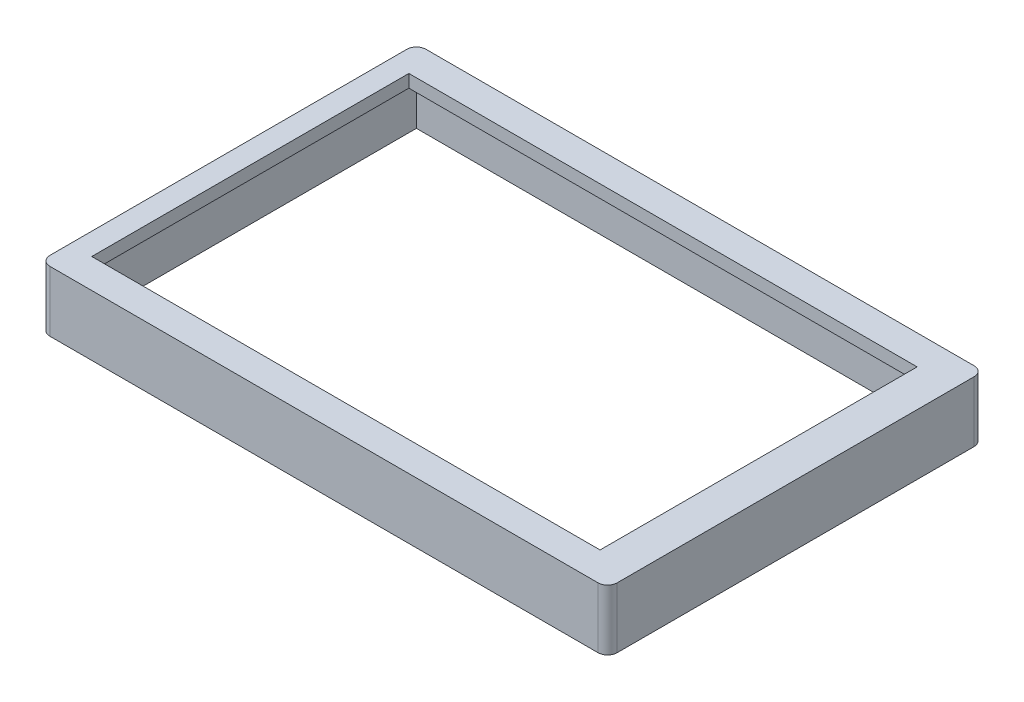
ISO-10303-21;
HEADER;
FILE_DESCRIPTION(('STEP AP214'),'2;1');
FILE_NAME('part.step','',(''),(''),'','','');
FILE_SCHEMA(('AUTOMOTIVE_DESIGN { 1 0 10303 214 1 1 1 1 }'));
ENDSEC;
DATA;
#1=APPLICATION_CONTEXT('core data for automotive mechanical design processes');
#2=APPLICATION_PROTOCOL_DEFINITION('international standard','automotive_design',2000,#1);
#3=PRODUCT_CONTEXT('',#1,'mechanical');
#4=PRODUCT('Part','Part','',(#3));
#5=PRODUCT_RELATED_PRODUCT_CATEGORY('part','',(#4));
#6=PRODUCT_DEFINITION_FORMATION('','',#4);
#7=PRODUCT_DEFINITION_CONTEXT('part definition',#1,'design');
#8=PRODUCT_DEFINITION('design','',#6,#7);
#9=PRODUCT_DEFINITION_SHAPE('','',#8);
#10=(LENGTH_UNIT() NAMED_UNIT(*) SI_UNIT(.MILLI.,.METRE.));
#11=(NAMED_UNIT(*) PLANE_ANGLE_UNIT() SI_UNIT($,.RADIAN.));
#12=(NAMED_UNIT(*) SI_UNIT($,.STERADIAN.) SOLID_ANGLE_UNIT());
#13=UNCERTAINTY_MEASURE_WITH_UNIT(LENGTH_MEASURE(1.E-05),#10,'distance_accuracy_value','');
#14=(GEOMETRIC_REPRESENTATION_CONTEXT(3) GLOBAL_UNCERTAINTY_ASSIGNED_CONTEXT((#13)) GLOBAL_UNIT_ASSIGNED_CONTEXT((#10,
#11,#12)) REPRESENTATION_CONTEXT('',''));
#15=CARTESIAN_POINT('',(0.,0.,0.));
#16=DIRECTION('',(0.,0.,1.));
#17=DIRECTION('',(1.,0.,0.));
#18=AXIS2_PLACEMENT_3D('',#15,#16,#17);
#19=CARTESIAN_POINT('',(0.,4.,0.));
#20=DIRECTION('',(0.,1.,0.));
#21=DIRECTION('',(0.,0.,1.));
#22=AXIS2_PLACEMENT_3D('',#19,#20,#21);
#23=PLANE('',#22);
#24=DIRECTION('',(-1.,0.,0.));
#25=VECTOR('',#24,1.);
#26=CARTESIAN_POINT('',(-86.6347978675137,4.,-59.));
#27=LINE('',#26,#25);
#28=CARTESIAN_POINT('',(88.3652021324864,4.,-59.));
#29=VERTEX_POINT('',#28);
#30=CARTESIAN_POINT('',(-83.6347978675137,4.,-59.));
#31=VERTEX_POINT('',#30);
#32=EDGE_CURVE('E239',#29,#31,#27,.T.);
#33=ORIENTED_EDGE('',*,*,#32,.T.);
#34=CARTESIAN_POINT('',(-83.6347978675137,4.,-56.));
#35=DIRECTION('',(0.,1.,0.));
#36=DIRECTION('',(0.,0.,1.));
#37=AXIS2_PLACEMENT_3D('',#34,#35,#36);
#38=CIRCLE('',#37,3.);
#39=CARTESIAN_POINT('',(-86.6347978675137,4.,-56.));
#40=VERTEX_POINT('',#39);
#41=EDGE_CURVE('E265',#31,#40,#38,.T.);
#42=ORIENTED_EDGE('',*,*,#41,.T.);
#43=DIRECTION('',(0.,0.,1.));
#44=VECTOR('',#43,1.);
#45=CARTESIAN_POINT('',(-86.6347978675137,4.,-59.));
#46=LINE('',#45,#44);
#47=CARTESIAN_POINT('',(-86.6347978675137,4.,56.));
#48=VERTEX_POINT('',#47);
#49=EDGE_CURVE('E232',#40,#48,#46,.T.);
#50=ORIENTED_EDGE('',*,*,#49,.T.);
#51=CARTESIAN_POINT('',(-83.6347978675137,4.,56.));
#52=DIRECTION('',(0.,1.,0.));
#53=DIRECTION('',(0.,0.,1.));
#54=AXIS2_PLACEMENT_3D('',#51,#52,#53);
#55=CIRCLE('',#54,3.);
#56=CARTESIAN_POINT('',(-83.6347978675137,4.,59.));
#57=VERTEX_POINT('',#56);
#58=EDGE_CURVE('E260',#48,#57,#55,.T.);
#59=ORIENTED_EDGE('',*,*,#58,.T.);
#60=DIRECTION('',(1.,0.,0.));
#61=VECTOR('',#60,1.);
#62=CARTESIAN_POINT('',(-86.6347978675137,4.,59.));
#63=LINE('',#62,#61);
#64=CARTESIAN_POINT('',(88.3652021324864,4.,59.));
#65=VERTEX_POINT('',#64);
#66=EDGE_CURVE('E235',#57,#65,#63,.T.);
#67=ORIENTED_EDGE('',*,*,#66,.T.);
#68=CARTESIAN_POINT('',(88.3652021324864,4.,56.));
#69=DIRECTION('',(0.,1.,0.));
#70=DIRECTION('',(0.,0.,1.));
#71=AXIS2_PLACEMENT_3D('',#68,#69,#70);
#72=CIRCLE('',#71,3.);
#73=CARTESIAN_POINT('',(91.3652021324864,4.,56.));
#74=VERTEX_POINT('',#73);
#75=EDGE_CURVE('E55',#65,#74,#72,.T.);
#76=ORIENTED_EDGE('',*,*,#75,.T.);
#77=DIRECTION('',(0.,0.,-1.));
#78=VECTOR('',#77,1.);
#79=CARTESIAN_POINT('',(91.3652021324864,4.,-59.));
#80=LINE('',#79,#78);
#81=CARTESIAN_POINT('',(91.3652021324864,4.,-56.));
#82=VERTEX_POINT('',#81);
#83=EDGE_CURVE('E237',#74,#82,#80,.T.);
#84=ORIENTED_EDGE('',*,*,#83,.T.);
#85=CARTESIAN_POINT('',(88.3652021324864,4.,-56.));
#86=DIRECTION('',(0.,1.,0.));
#87=DIRECTION('',(0.,0.,1.));
#88=AXIS2_PLACEMENT_3D('',#85,#86,#87);
#89=CIRCLE('',#88,3.);
#90=EDGE_CURVE('E263',#82,#29,#89,.T.);
#91=ORIENTED_EDGE('',*,*,#90,.T.);
#92=EDGE_LOOP('',(#33,#42,#50,#59,#67,#76,#84,#91));
#93=FACE_BOUND('',#92,.T.);
#94=DIRECTION('',(-1.,0.,0.));
#95=VECTOR('',#94,1.);
#96=CARTESIAN_POINT('',(-79.75,4.,-49.75));
#97=LINE('',#96,#95);
#98=CARTESIAN_POINT('',(79.75,4.,-49.75));
#99=VERTEX_POINT('',#98);
#100=CARTESIAN_POINT('',(-79.75,4.,-49.75));
#101=VERTEX_POINT('',#100);
#102=EDGE_CURVE('E204',#99,#101,#97,.T.);
#103=ORIENTED_EDGE('',*,*,#102,.F.);
#104=DIRECTION('',(0.,0.,-1.));
#105=VECTOR('',#104,1.);
#106=CARTESIAN_POINT('',(79.75,4.,-49.75));
#107=LINE('',#106,#105);
#108=CARTESIAN_POINT('',(79.75,4.,49.75));
#109=VERTEX_POINT('',#108);
#110=EDGE_CURVE('E202',#109,#99,#107,.T.);
#111=ORIENTED_EDGE('',*,*,#110,.F.);
#112=DIRECTION('',(1.,0.,0.));
#113=VECTOR('',#112,1.);
#114=CARTESIAN_POINT('',(-79.75,4.,49.75));
#115=LINE('',#114,#113);
#116=CARTESIAN_POINT('',(-79.75,4.,49.75));
#117=VERTEX_POINT('',#116);
#118=EDGE_CURVE('E210',#117,#109,#115,.T.);
#119=ORIENTED_EDGE('',*,*,#118,.F.);
#120=DIRECTION('',(0.,0.,1.));
#121=VECTOR('',#120,1.);
#122=CARTESIAN_POINT('',(-79.75,4.,-49.75));
#123=LINE('',#122,#121);
#124=EDGE_CURVE('E207',#101,#117,#123,.T.);
#125=ORIENTED_EDGE('',*,*,#124,.F.);
#126=EDGE_LOOP('',(#103,#111,#119,#125));
#127=FACE_BOUND('',#126,.T.);
#128=ADVANCED_FACE('F33',(#93,#127),#23,.T.);
#129=CARTESIAN_POINT('',(0.,0.,0.));
#130=DIRECTION('',(0.,1.,0.));
#131=DIRECTION('',(0.,0.,1.));
#132=AXIS2_PLACEMENT_3D('',#129,#130,#131);
#133=PLANE('',#132);
#134=DIRECTION('',(0.,0.,1.));
#135=VECTOR('',#134,1.);
#136=CARTESIAN_POINT('',(87.3652021324864,0.,-55.));
#137=LINE('',#136,#135);
#138=CARTESIAN_POINT('',(87.3652021324864,0.,-55.));
#139=VERTEX_POINT('',#138);
#140=CARTESIAN_POINT('',(87.3652021324864,0.,55.));
#141=VERTEX_POINT('',#140);
#142=EDGE_CURVE('E159',#139,#141,#137,.T.);
#143=ORIENTED_EDGE('',*,*,#142,.T.);
#144=DIRECTION('',(-1.,0.,0.));
#145=VECTOR('',#144,1.);
#146=CARTESIAN_POINT('',(87.3652021324864,0.,55.));
#147=LINE('',#146,#145);
#148=CARTESIAN_POINT('',(-82.6347978675137,0.,55.));
#149=VERTEX_POINT('',#148);
#150=EDGE_CURVE('E178',#141,#149,#147,.T.);
#151=ORIENTED_EDGE('',*,*,#150,.T.);
#152=DIRECTION('',(0.,0.,-1.));
#153=VECTOR('',#152,1.);
#154=CARTESIAN_POINT('',(-82.6347978675137,0.,55.));
#155=LINE('',#154,#153);
#156=CARTESIAN_POINT('',(-82.6347978675137,0.,-55.));
#157=VERTEX_POINT('',#156);
#158=EDGE_CURVE('E165',#149,#157,#155,.T.);
#159=ORIENTED_EDGE('',*,*,#158,.T.);
#160=DIRECTION('',(1.,0.,0.));
#161=VECTOR('',#160,1.);
#162=CARTESIAN_POINT('',(-82.6347978675137,0.,-55.));
#163=LINE('',#162,#161);
#164=EDGE_CURVE('E181',#157,#139,#163,.T.);
#165=ORIENTED_EDGE('',*,*,#164,.T.);
#166=EDGE_LOOP('',(#143,#151,#159,#165));
#167=FACE_BOUND('',#166,.T.);
#168=DIRECTION('',(0.,0.,-1.));
#169=VECTOR('',#168,1.);
#170=CARTESIAN_POINT('',(79.75,0.,-49.75));
#171=LINE('',#170,#169);
#172=CARTESIAN_POINT('',(79.75,0.,49.75));
#173=VERTEX_POINT('',#172);
#174=CARTESIAN_POINT('',(79.75,0.,-49.75));
#175=VERTEX_POINT('',#174);
#176=EDGE_CURVE('E201',#173,#175,#171,.T.);
#177=ORIENTED_EDGE('',*,*,#176,.T.);
#178=DIRECTION('',(-1.,0.,0.));
#179=VECTOR('',#178,1.);
#180=CARTESIAN_POINT('',(-79.75,0.,-49.75));
#181=LINE('',#180,#179);
#182=CARTESIAN_POINT('',(-79.75,0.,-49.75));
#183=VERTEX_POINT('',#182);
#184=EDGE_CURVE('E215',#175,#183,#181,.T.);
#185=ORIENTED_EDGE('',*,*,#184,.T.);
#186=DIRECTION('',(0.,0.,1.));
#187=VECTOR('',#186,1.);
#188=CARTESIAN_POINT('',(-79.75,0.,-49.75));
#189=LINE('',#188,#187);
#190=CARTESIAN_POINT('',(-79.75,0.,49.75));
#191=VERTEX_POINT('',#190);
#192=EDGE_CURVE('E218',#183,#191,#189,.T.);
#193=ORIENTED_EDGE('',*,*,#192,.T.);
#194=DIRECTION('',(1.,0.,0.));
#195=VECTOR('',#194,1.);
#196=CARTESIAN_POINT('',(-79.75,0.,49.75));
#197=LINE('',#196,#195);
#198=EDGE_CURVE('E205',#191,#173,#197,.T.);
#199=ORIENTED_EDGE('',*,*,#198,.T.);
#200=EDGE_LOOP('',(#177,#185,#193,#199));
#201=FACE_BOUND('',#200,.T.);
#202=ADVANCED_FACE('F308',(#167,#201),#133,.F.);
#203=CARTESIAN_POINT('',(-86.6347978675137,4.,-59.));
#204=DIRECTION('',(1.,0.,0.));
#205=DIRECTION('',(0.,0.,-1.));
#206=AXIS2_PLACEMENT_3D('',#203,#204,#205);
#207=PLANE('',#206);
#208=ORIENTED_EDGE('',*,*,#49,.F.);
#209=DIRECTION('',(0.,-1.,0.));
#210=VECTOR('',#209,1.);
#211=CARTESIAN_POINT('',(-86.6347978675137,4.,-56.));
#212=LINE('',#211,#210);
#213=CARTESIAN_POINT('',(-86.6347978675137,-15.,-56.));
#214=VERTEX_POINT('',#213);
#215=EDGE_CURVE('E244',#40,#214,#212,.T.);
#216=ORIENTED_EDGE('',*,*,#215,.T.);
#217=DIRECTION('',(0.,0.,-1.));
#218=VECTOR('',#217,1.);
#219=CARTESIAN_POINT('',(-86.6347978675137,-15.,59.));
#220=LINE('',#219,#218);
#221=CARTESIAN_POINT('',(-86.6347978675137,-15.,56.));
#222=VERTEX_POINT('',#221);
#223=EDGE_CURVE('E192',#222,#214,#220,.T.);
#224=ORIENTED_EDGE('',*,*,#223,.F.);
#225=DIRECTION('',(0.,-1.,0.));
#226=VECTOR('',#225,1.);
#227=CARTESIAN_POINT('',(-86.6347978675137,4.,56.));
#228=LINE('',#227,#226);
#229=EDGE_CURVE('E242',#222,#48,#228,.F.);
#230=ORIENTED_EDGE('',*,*,#229,.T.);
#231=EDGE_LOOP('',(#208,#216,#224,#230));
#232=FACE_BOUND('',#231,.T.);
#233=ADVANCED_FACE('F301',(#232),#207,.F.);
#234=CARTESIAN_POINT('',(-86.6347978675137,4.,59.));
#235=DIRECTION('',(0.,0.,-1.));
#236=DIRECTION('',(-1.,0.,0.));
#237=AXIS2_PLACEMENT_3D('',#234,#235,#236);
#238=PLANE('',#237);
#239=DIRECTION('',(-1.,0.,0.));
#240=VECTOR('',#239,1.);
#241=CARTESIAN_POINT('',(91.3652021324864,-15.,59.));
#242=LINE('',#241,#240);
#243=CARTESIAN_POINT('',(88.3652021324864,-15.,59.));
#244=VERTEX_POINT('',#243);
#245=CARTESIAN_POINT('',(-83.6347978675137,-15.,59.));
#246=VERTEX_POINT('',#245);
#247=EDGE_CURVE('E166',#244,#246,#242,.T.);
#248=ORIENTED_EDGE('',*,*,#247,.F.);
#249=DIRECTION('',(0.,-1.,0.));
#250=VECTOR('',#249,1.);
#251=CARTESIAN_POINT('',(88.3652021324864,4.,59.));
#252=LINE('',#251,#250);
#253=EDGE_CURVE('E11',#244,#65,#252,.F.);
#254=ORIENTED_EDGE('',*,*,#253,.T.);
#255=ORIENTED_EDGE('',*,*,#66,.F.);
#256=DIRECTION('',(0.,-1.,0.));
#257=VECTOR('',#256,1.);
#258=CARTESIAN_POINT('',(-83.6347978675137,4.,59.));
#259=LINE('',#258,#257);
#260=EDGE_CURVE('E41',#57,#246,#259,.T.);
#261=ORIENTED_EDGE('',*,*,#260,.T.);
#262=EDGE_LOOP('',(#248,#254,#255,#261));
#263=FACE_BOUND('',#262,.T.);
#264=ADVANCED_FACE('F275',(#263),#238,.F.);
#265=CARTESIAN_POINT('',(91.3652021324864,4.,-59.));
#266=DIRECTION('',(-1.,0.,0.));
#267=DIRECTION('',(0.,0.,1.));
#268=AXIS2_PLACEMENT_3D('',#265,#266,#267);
#269=PLANE('',#268);
#270=DIRECTION('',(0.,0.,1.));
#271=VECTOR('',#270,1.);
#272=CARTESIAN_POINT('',(91.3652021324864,-15.,-59.));
#273=LINE('',#272,#271);
#274=CARTESIAN_POINT('',(91.3652021324864,-15.,-56.));
#275=VERTEX_POINT('',#274);
#276=CARTESIAN_POINT('',(91.3652021324864,-15.,56.));
#277=VERTEX_POINT('',#276);
#278=EDGE_CURVE('E198',#275,#277,#273,.T.);
#279=ORIENTED_EDGE('',*,*,#278,.F.);
#280=DIRECTION('',(0.,-1.,0.));
#281=VECTOR('',#280,1.);
#282=CARTESIAN_POINT('',(91.3652021324864,4.,-56.));
#283=LINE('',#282,#281);
#284=EDGE_CURVE('E48',#275,#82,#283,.F.);
#285=ORIENTED_EDGE('',*,*,#284,.T.);
#286=ORIENTED_EDGE('',*,*,#83,.F.);
#287=DIRECTION('',(0.,-1.,0.));
#288=VECTOR('',#287,1.);
#289=CARTESIAN_POINT('',(91.3652021324864,4.,56.));
#290=LINE('',#289,#288);
#291=EDGE_CURVE('E267',#74,#277,#290,.T.);
#292=ORIENTED_EDGE('',*,*,#291,.T.);
#293=EDGE_LOOP('',(#279,#285,#286,#292));
#294=FACE_BOUND('',#293,.T.);
#295=ADVANCED_FACE('F284',(#294),#269,.F.);
#296=CARTESIAN_POINT('',(-86.6347978675137,4.,-59.));
#297=DIRECTION('',(0.,0.,1.));
#298=DIRECTION('',(1.,0.,0.));
#299=AXIS2_PLACEMENT_3D('',#296,#297,#298);
#300=PLANE('',#299);
#301=DIRECTION('',(1.,0.,0.));
#302=VECTOR('',#301,1.);
#303=CARTESIAN_POINT('',(-86.6347978675137,-15.,-59.));
#304=LINE('',#303,#302);
#305=CARTESIAN_POINT('',(-83.6347978675137,-15.,-59.));
#306=VERTEX_POINT('',#305);
#307=CARTESIAN_POINT('',(88.3652021324864,-15.,-59.));
#308=VERTEX_POINT('',#307);
#309=EDGE_CURVE('E195',#306,#308,#304,.T.);
#310=ORIENTED_EDGE('',*,*,#309,.F.);
#311=DIRECTION('',(0.,-1.,0.));
#312=VECTOR('',#311,1.);
#313=CARTESIAN_POINT('',(-83.6347978675137,4.,-59.));
#314=LINE('',#313,#312);
#315=EDGE_CURVE('E258',#306,#31,#314,.F.);
#316=ORIENTED_EDGE('',*,*,#315,.T.);
#317=ORIENTED_EDGE('',*,*,#32,.F.);
#318=DIRECTION('',(0.,-1.,0.));
#319=VECTOR('',#318,1.);
#320=CARTESIAN_POINT('',(88.3652021324864,4.,-59.));
#321=LINE('',#320,#319);
#322=EDGE_CURVE('E255',#29,#308,#321,.T.);
#323=ORIENTED_EDGE('',*,*,#322,.T.);
#324=EDGE_LOOP('',(#310,#316,#317,#323));
#325=FACE_BOUND('',#324,.T.);
#326=ADVANCED_FACE('F293',(#325),#300,.F.);
#327=CARTESIAN_POINT('',(79.75,4.,-49.75));
#328=DIRECTION('',(-1.,0.,0.));
#329=DIRECTION('',(0.,0.,1.));
#330=AXIS2_PLACEMENT_3D('',#327,#328,#329);
#331=PLANE('',#330);
#332=ORIENTED_EDGE('',*,*,#176,.F.);
#333=DIRECTION('',(0.,-1.,0.));
#334=VECTOR('',#333,1.);
#335=CARTESIAN_POINT('',(79.75,4.,49.75));
#336=LINE('',#335,#334);
#337=EDGE_CURVE('E212',#109,#173,#336,.T.);
#338=ORIENTED_EDGE('',*,*,#337,.F.);
#339=ORIENTED_EDGE('',*,*,#110,.T.);
#340=DIRECTION('',(0.,-1.,0.));
#341=VECTOR('',#340,1.);
#342=CARTESIAN_POINT('',(79.75,4.,-49.75));
#343=LINE('',#342,#341);
#344=EDGE_CURVE('E229',#99,#175,#343,.T.);
#345=ORIENTED_EDGE('',*,*,#344,.T.);
#346=EDGE_LOOP('',(#332,#338,#339,#345));
#347=FACE_BOUND('',#346,.T.);
#348=ADVANCED_FACE('F316',(#347),#331,.T.);
#349=CARTESIAN_POINT('',(-79.75,4.,-49.75));
#350=DIRECTION('',(0.,0.,1.));
#351=DIRECTION('',(1.,0.,0.));
#352=AXIS2_PLACEMENT_3D('',#349,#350,#351);
#353=PLANE('',#352);
#354=ORIENTED_EDGE('',*,*,#184,.F.);
#355=ORIENTED_EDGE('',*,*,#344,.F.);
#356=ORIENTED_EDGE('',*,*,#102,.T.);
#357=DIRECTION('',(0.,-1.,0.));
#358=VECTOR('',#357,1.);
#359=CARTESIAN_POINT('',(-79.75,4.,-49.75));
#360=LINE('',#359,#358);
#361=EDGE_CURVE('E227',#101,#183,#360,.T.);
#362=ORIENTED_EDGE('',*,*,#361,.T.);
#363=EDGE_LOOP('',(#354,#355,#356,#362));
#364=FACE_BOUND('',#363,.T.);
#365=ADVANCED_FACE('F442',(#364),#353,.T.);
#366=CARTESIAN_POINT('',(-79.75,4.,-49.75));
#367=DIRECTION('',(1.,0.,0.));
#368=DIRECTION('',(0.,0.,-1.));
#369=AXIS2_PLACEMENT_3D('',#366,#367,#368);
#370=PLANE('',#369);
#371=ORIENTED_EDGE('',*,*,#192,.F.);
#372=ORIENTED_EDGE('',*,*,#361,.F.);
#373=ORIENTED_EDGE('',*,*,#124,.T.);
#374=DIRECTION('',(0.,-1.,0.));
#375=VECTOR('',#374,1.);
#376=CARTESIAN_POINT('',(-79.75,4.,49.75));
#377=LINE('',#376,#375);
#378=EDGE_CURVE('E225',#117,#191,#377,.T.);
#379=ORIENTED_EDGE('',*,*,#378,.T.);
#380=EDGE_LOOP('',(#371,#372,#373,#379));
#381=FACE_BOUND('',#380,.T.);
#382=ADVANCED_FACE('F433',(#381),#370,.T.);
#383=CARTESIAN_POINT('',(-79.75,4.,49.75));
#384=DIRECTION('',(0.,0.,-1.));
#385=DIRECTION('',(-1.,0.,0.));
#386=AXIS2_PLACEMENT_3D('',#383,#384,#385);
#387=PLANE('',#386);
#388=ORIENTED_EDGE('',*,*,#198,.F.);
#389=ORIENTED_EDGE('',*,*,#378,.F.);
#390=ORIENTED_EDGE('',*,*,#118,.T.);
#391=ORIENTED_EDGE('',*,*,#337,.T.);
#392=EDGE_LOOP('',(#388,#389,#390,#391));
#393=FACE_BOUND('',#392,.T.);
#394=ADVANCED_FACE('F391',(#393),#387,.T.);
#395=CARTESIAN_POINT('',(0.,-15.,0.));
#396=DIRECTION('',(0.,-1.,0.));
#397=DIRECTION('',(0.,0.,-1.));
#398=AXIS2_PLACEMENT_3D('',#395,#396,#397);
#399=PLANE('',#398);
#400=ORIENTED_EDGE('',*,*,#223,.T.);
#401=CARTESIAN_POINT('',(-83.6347978675137,-15.,-56.));
#402=DIRECTION('',(0.,-1.,0.));
#403=DIRECTION('',(0.,0.,-1.));
#404=AXIS2_PLACEMENT_3D('',#401,#402,#403);
#405=CIRCLE('',#404,3.);
#406=EDGE_CURVE('E253',#214,#306,#405,.T.);
#407=ORIENTED_EDGE('',*,*,#406,.T.);
#408=ORIENTED_EDGE('',*,*,#309,.T.);
#409=CARTESIAN_POINT('',(88.3652021324864,-15.,-56.));
#410=DIRECTION('',(0.,-1.,0.));
#411=DIRECTION('',(0.,0.,-1.));
#412=AXIS2_PLACEMENT_3D('',#409,#410,#411);
#413=CIRCLE('',#412,3.);
#414=EDGE_CURVE('E251',#308,#275,#413,.T.);
#415=ORIENTED_EDGE('',*,*,#414,.T.);
#416=ORIENTED_EDGE('',*,*,#278,.T.);
#417=CARTESIAN_POINT('',(88.3652021324864,-15.,56.));
#418=DIRECTION('',(0.,-1.,0.));
#419=DIRECTION('',(0.,0.,-1.));
#420=AXIS2_PLACEMENT_3D('',#417,#418,#419);
#421=CIRCLE('',#420,3.);
#422=EDGE_CURVE('E249',#277,#244,#421,.T.);
#423=ORIENTED_EDGE('',*,*,#422,.T.);
#424=ORIENTED_EDGE('',*,*,#247,.T.);
#425=CARTESIAN_POINT('',(-83.6347978675137,-15.,56.));
#426=DIRECTION('',(0.,-1.,0.));
#427=DIRECTION('',(0.,0.,-1.));
#428=AXIS2_PLACEMENT_3D('',#425,#426,#427);
#429=CIRCLE('',#428,3.);
#430=EDGE_CURVE('E247',#246,#222,#429,.T.);
#431=ORIENTED_EDGE('',*,*,#430,.T.);
#432=EDGE_LOOP('',(#400,#407,#408,#415,#416,#423,#424,#431));
#433=FACE_BOUND('',#432,.T.);
#434=DIRECTION('',(0.,0.,-1.));
#435=VECTOR('',#434,1.);
#436=CARTESIAN_POINT('',(-82.6347978675137,-15.,55.));
#437=LINE('',#436,#435);
#438=CARTESIAN_POINT('',(-82.6347978675137,-15.,55.));
#439=VERTEX_POINT('',#438);
#440=CARTESIAN_POINT('',(-82.6347978675137,-15.,-55.));
#441=VERTEX_POINT('',#440);
#442=EDGE_CURVE('E158',#439,#441,#437,.T.);
#443=ORIENTED_EDGE('',*,*,#442,.F.);
#444=DIRECTION('',(-1.,0.,0.));
#445=VECTOR('',#444,1.);
#446=CARTESIAN_POINT('',(87.3652021324864,-15.,55.));
#447=LINE('',#446,#445);
#448=CARTESIAN_POINT('',(87.3652021324864,-15.,55.));
#449=VERTEX_POINT('',#448);
#450=EDGE_CURVE('E148',#449,#439,#447,.T.);
#451=ORIENTED_EDGE('',*,*,#450,.F.);
#452=DIRECTION('',(0.,0.,1.));
#453=VECTOR('',#452,1.);
#454=CARTESIAN_POINT('',(87.3652021324864,-15.,-55.));
#455=LINE('',#454,#453);
#456=CARTESIAN_POINT('',(87.3652021324864,-15.,-55.));
#457=VERTEX_POINT('',#456);
#458=EDGE_CURVE('E174',#457,#449,#455,.T.);
#459=ORIENTED_EDGE('',*,*,#458,.F.);
#460=DIRECTION('',(1.,0.,0.));
#461=VECTOR('',#460,1.);
#462=CARTESIAN_POINT('',(-82.6347978675137,-15.,-55.));
#463=LINE('',#462,#461);
#464=EDGE_CURVE('E172',#441,#457,#463,.T.);
#465=ORIENTED_EDGE('',*,*,#464,.F.);
#466=EDGE_LOOP('',(#443,#451,#459,#465));
#467=FACE_BOUND('',#466,.T.);
#468=ADVANCED_FACE('F170',(#433,#467),#399,.T.);
#469=CARTESIAN_POINT('',(87.3652021324864,-15.,55.));
#470=DIRECTION('',(0.,0.,-1.));
#471=DIRECTION('',(-1.,0.,0.));
#472=AXIS2_PLACEMENT_3D('',#469,#470,#471);
#473=PLANE('',#472);
#474=ORIENTED_EDGE('',*,*,#150,.F.);
#475=DIRECTION('',(0.,1.,0.));
#476=VECTOR('',#475,1.);
#477=CARTESIAN_POINT('',(87.3652021324864,-15.,55.));
#478=LINE('',#477,#476);
#479=EDGE_CURVE('E154',#449,#141,#478,.T.);
#480=ORIENTED_EDGE('',*,*,#479,.F.);
#481=ORIENTED_EDGE('',*,*,#450,.T.);
#482=DIRECTION('',(0.,1.,0.));
#483=VECTOR('',#482,1.);
#484=CARTESIAN_POINT('',(-82.6347978675137,-15.,55.));
#485=LINE('',#484,#483);
#486=EDGE_CURVE('E152',#439,#149,#485,.T.);
#487=ORIENTED_EDGE('',*,*,#486,.T.);
#488=EDGE_LOOP('',(#474,#480,#481,#487));
#489=FACE_BOUND('',#488,.T.);
#490=ADVANCED_FACE('F151',(#489),#473,.T.);
#491=CARTESIAN_POINT('',(-82.6347978675137,-15.,55.));
#492=DIRECTION('',(1.,0.,0.));
#493=DIRECTION('',(0.,0.,-1.));
#494=AXIS2_PLACEMENT_3D('',#491,#492,#493);
#495=PLANE('',#494);
#496=ORIENTED_EDGE('',*,*,#158,.F.);
#497=ORIENTED_EDGE('',*,*,#486,.F.);
#498=ORIENTED_EDGE('',*,*,#442,.T.);
#499=DIRECTION('',(0.,1.,0.));
#500=VECTOR('',#499,1.);
#501=CARTESIAN_POINT('',(-82.6347978675137,-15.,-55.));
#502=LINE('',#501,#500);
#503=EDGE_CURVE('E167',#441,#157,#502,.T.);
#504=ORIENTED_EDGE('',*,*,#503,.T.);
#505=EDGE_LOOP('',(#496,#497,#498,#504));
#506=FACE_BOUND('',#505,.T.);
#507=ADVANCED_FACE('F162',(#506),#495,.T.);
#508=CARTESIAN_POINT('',(-82.6347978675137,-15.,-55.));
#509=DIRECTION('',(0.,0.,1.));
#510=DIRECTION('',(1.,0.,0.));
#511=AXIS2_PLACEMENT_3D('',#508,#509,#510);
#512=PLANE('',#511);
#513=ORIENTED_EDGE('',*,*,#164,.F.);
#514=ORIENTED_EDGE('',*,*,#503,.F.);
#515=ORIENTED_EDGE('',*,*,#464,.T.);
#516=DIRECTION('',(0.,1.,0.));
#517=VECTOR('',#516,1.);
#518=CARTESIAN_POINT('',(87.3652021324864,-15.,-55.));
#519=LINE('',#518,#517);
#520=EDGE_CURVE('E187',#457,#139,#519,.T.);
#521=ORIENTED_EDGE('',*,*,#520,.T.);
#522=EDGE_LOOP('',(#513,#514,#515,#521));
#523=FACE_BOUND('',#522,.T.);
#524=ADVANCED_FACE('F360',(#523),#512,.T.);
#525=CARTESIAN_POINT('',(87.3652021324864,-15.,-55.));
#526=DIRECTION('',(-1.,0.,0.));
#527=DIRECTION('',(0.,0.,1.));
#528=AXIS2_PLACEMENT_3D('',#525,#526,#527);
#529=PLANE('',#528);
#530=ORIENTED_EDGE('',*,*,#142,.F.);
#531=ORIENTED_EDGE('',*,*,#520,.F.);
#532=ORIENTED_EDGE('',*,*,#458,.T.);
#533=ORIENTED_EDGE('',*,*,#479,.T.);
#534=EDGE_LOOP('',(#530,#531,#532,#533));
#535=FACE_BOUND('',#534,.T.);
#536=ADVANCED_FACE('F329',(#535),#529,.T.);
#537=CARTESIAN_POINT('',(-83.6347978675137,4.,-56.));
#538=DIRECTION('',(0.,-1.,0.));
#539=DIRECTION('',(0.,0.,-1.));
#540=AXIS2_PLACEMENT_3D('',#537,#538,#539);
#541=CYLINDRICAL_SURFACE('',#540,3.);
#542=ORIENTED_EDGE('',*,*,#41,.F.);
#543=ORIENTED_EDGE('',*,*,#315,.F.);
#544=ORIENTED_EDGE('',*,*,#406,.F.);
#545=ORIENTED_EDGE('',*,*,#215,.F.);
#546=EDGE_LOOP('',(#542,#543,#544,#545));
#547=FACE_BOUND('',#546,.T.);
#548=ADVANCED_FACE('F298',(#547),#541,.T.);
#549=CARTESIAN_POINT('',(88.3652021324864,4.,-56.));
#550=DIRECTION('',(0.,-1.,0.));
#551=DIRECTION('',(0.,0.,-1.));
#552=AXIS2_PLACEMENT_3D('',#549,#550,#551);
#553=CYLINDRICAL_SURFACE('',#552,3.);
#554=ORIENTED_EDGE('',*,*,#90,.F.);
#555=ORIENTED_EDGE('',*,*,#284,.F.);
#556=ORIENTED_EDGE('',*,*,#414,.F.);
#557=ORIENTED_EDGE('',*,*,#322,.F.);
#558=EDGE_LOOP('',(#554,#555,#556,#557));
#559=FACE_BOUND('',#558,.T.);
#560=ADVANCED_FACE('F290',(#559),#553,.T.);
#561=CARTESIAN_POINT('',(88.3652021324864,4.,56.));
#562=DIRECTION('',(0.,-1.,0.));
#563=DIRECTION('',(0.,0.,-1.));
#564=AXIS2_PLACEMENT_3D('',#561,#562,#563);
#565=CYLINDRICAL_SURFACE('',#564,3.);
#566=ORIENTED_EDGE('',*,*,#75,.F.);
#567=ORIENTED_EDGE('',*,*,#253,.F.);
#568=ORIENTED_EDGE('',*,*,#422,.F.);
#569=ORIENTED_EDGE('',*,*,#291,.F.);
#570=EDGE_LOOP('',(#566,#567,#568,#569));
#571=FACE_BOUND('',#570,.T.);
#572=ADVANCED_FACE('F283',(#571),#565,.T.);
#573=CARTESIAN_POINT('',(-83.6347978675137,4.,56.));
#574=DIRECTION('',(0.,-1.,0.));
#575=DIRECTION('',(0.,0.,-1.));
#576=AXIS2_PLACEMENT_3D('',#573,#574,#575);
#577=CYLINDRICAL_SURFACE('',#576,3.);
#578=ORIENTED_EDGE('',*,*,#58,.F.);
#579=ORIENTED_EDGE('',*,*,#229,.F.);
#580=ORIENTED_EDGE('',*,*,#430,.F.);
#581=ORIENTED_EDGE('',*,*,#260,.F.);
#582=EDGE_LOOP('',(#578,#579,#580,#581));
#583=FACE_BOUND('',#582,.T.);
#584=ADVANCED_FACE('F35',(#583),#577,.T.);
#585=CLOSED_SHELL('',(#128,#202,#233,#264,#295,#326,#348,#365,#382,#394,#468,#490,#507,#524,
#536,#548,#560,#572,#584));
#586=MANIFOLD_SOLID_BREP('B2',#585);
#587=ADVANCED_BREP_SHAPE_REPRESENTATION('',(#18,#586),#14);
#588=SHAPE_DEFINITION_REPRESENTATION(#9,#587);
ENDSEC;
END-ISO-10303-21;
